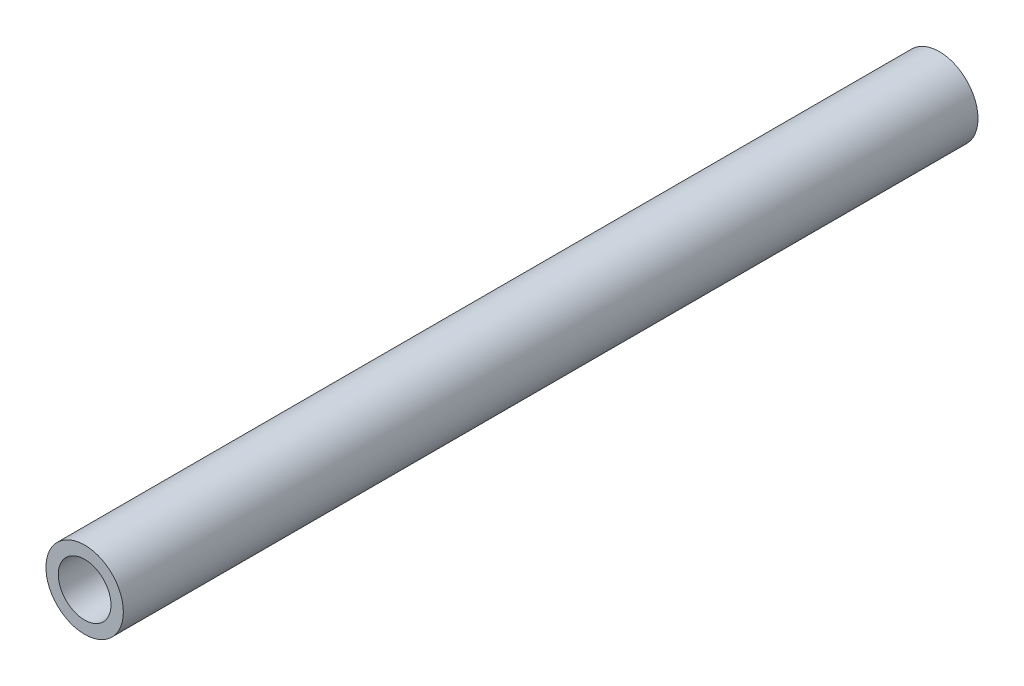
ISO-10303-21;
HEADER;
FILE_DESCRIPTION(('STEP AP214'),'2;1');
FILE_NAME('part.step','',(''),(''),'','','');
FILE_SCHEMA(('AUTOMOTIVE_DESIGN { 1 0 10303 214 1 1 1 1 }'));
ENDSEC;
DATA;
#1=APPLICATION_CONTEXT('core data for automotive mechanical design processes');
#2=APPLICATION_PROTOCOL_DEFINITION('international standard','automotive_design',2000,#1);
#3=PRODUCT_CONTEXT('',#1,'mechanical');
#4=PRODUCT('Part','Part','',(#3));
#5=PRODUCT_RELATED_PRODUCT_CATEGORY('part','',(#4));
#6=PRODUCT_DEFINITION_FORMATION('','',#4);
#7=PRODUCT_DEFINITION_CONTEXT('part definition',#1,'design');
#8=PRODUCT_DEFINITION('design','',#6,#7);
#9=PRODUCT_DEFINITION_SHAPE('','',#8);
#10=(LENGTH_UNIT() NAMED_UNIT(*) SI_UNIT(.MILLI.,.METRE.));
#11=(NAMED_UNIT(*) PLANE_ANGLE_UNIT() SI_UNIT($,.RADIAN.));
#12=(NAMED_UNIT(*) SI_UNIT($,.STERADIAN.) SOLID_ANGLE_UNIT());
#13=UNCERTAINTY_MEASURE_WITH_UNIT(LENGTH_MEASURE(1.E-05),#10,'distance_accuracy_value','');
#14=(GEOMETRIC_REPRESENTATION_CONTEXT(3) GLOBAL_UNCERTAINTY_ASSIGNED_CONTEXT((#13)) GLOBAL_UNIT_ASSIGNED_CONTEXT((#10,
#11,#12)) REPRESENTATION_CONTEXT('',''));
#15=CARTESIAN_POINT('',(0.,0.,0.));
#16=DIRECTION('',(0.,0.,1.));
#17=DIRECTION('',(1.,0.,0.));
#18=AXIS2_PLACEMENT_3D('',#15,#16,#17);
#19=CARTESIAN_POINT('',(-36.480993275143,23.345303086753,138.));
#20=DIRECTION('',(0.,0.,1.));
#21=DIRECTION('',(1.,0.,0.));
#22=AXIS2_PLACEMENT_3D('',#19,#20,#21);
#23=PLANE('',#22);
#24=CARTESIAN_POINT('',(-36.480993275143,23.345303086753,138.));
#25=DIRECTION('',(0.,0.,1.));
#26=DIRECTION('',(1.,0.,0.));
#27=AXIS2_PLACEMENT_3D('',#24,#25,#26);
#28=CIRCLE('',#27,6.25);
#29=CARTESIAN_POINT('',(-30.230993275143,23.345303086753,138.));
#30=VERTEX_POINT('',#29);
#31=EDGE_CURVE('E10',#30,#30,#28,.T.);
#32=ORIENTED_EDGE('',*,*,#31,.T.);
#33=EDGE_LOOP('',(#32));
#34=FACE_BOUND('',#33,.T.);
#35=CARTESIAN_POINT('',(-36.480993275143,23.345303086753,138.));
#36=DIRECTION('',(0.,0.,1.));
#37=DIRECTION('',(1.,0.,0.));
#38=AXIS2_PLACEMENT_3D('',#35,#36,#37);
#39=CIRCLE('',#38,4.25);
#40=CARTESIAN_POINT('',(-32.230993275143,23.345303086753,138.));
#41=VERTEX_POINT('',#40);
#42=EDGE_CURVE('E50',#41,#41,#39,.T.);
#43=ORIENTED_EDGE('',*,*,#42,.F.);
#44=EDGE_LOOP('',(#43));
#45=FACE_BOUND('',#44,.T.);
#46=ADVANCED_FACE('F37',(#34,#45),#23,.T.);
#47=CARTESIAN_POINT('',(-36.480993275143,23.345303086753,0.));
#48=DIRECTION('',(0.,0.,1.));
#49=DIRECTION('',(1.,0.,0.));
#50=AXIS2_PLACEMENT_3D('',#47,#48,#49);
#51=PLANE('',#50);
#52=CARTESIAN_POINT('',(-36.480993275143,23.345303086753,0.));
#53=DIRECTION('',(0.,0.,1.));
#54=DIRECTION('',(1.,0.,0.));
#55=AXIS2_PLACEMENT_3D('',#52,#53,#54);
#56=CIRCLE('',#55,6.25);
#57=CARTESIAN_POINT('',(-30.230993275143,23.345303086753,0.));
#58=VERTEX_POINT('',#57);
#59=EDGE_CURVE('E41',#58,#58,#56,.T.);
#60=ORIENTED_EDGE('',*,*,#59,.F.);
#61=EDGE_LOOP('',(#60));
#62=FACE_BOUND('',#61,.T.);
#63=CARTESIAN_POINT('',(-36.480993275143,23.345303086753,0.));
#64=DIRECTION('',(0.,0.,1.));
#65=DIRECTION('',(1.,0.,0.));
#66=AXIS2_PLACEMENT_3D('',#63,#64,#65);
#67=CIRCLE('',#66,4.25);
#68=CARTESIAN_POINT('',(-32.230993275143,23.345303086753,0.));
#69=VERTEX_POINT('',#68);
#70=EDGE_CURVE('E52',#69,#69,#67,.T.);
#71=ORIENTED_EDGE('',*,*,#70,.T.);
#72=EDGE_LOOP('',(#71));
#73=FACE_BOUND('',#72,.T.);
#74=ADVANCED_FACE('F64',(#62,#73),#51,.F.);
#75=CARTESIAN_POINT('',(-36.480993275143,23.345303086753,138.));
#76=DIRECTION('',(0.,0.,-1.));
#77=DIRECTION('',(-1.,0.,0.));
#78=AXIS2_PLACEMENT_3D('',#75,#76,#77);
#79=CYLINDRICAL_SURFACE('',#78,6.25);
#80=ORIENTED_EDGE('',*,*,#31,.F.);
#81=EDGE_LOOP('',(#80));
#82=FACE_BOUND('',#81,.T.);
#83=ORIENTED_EDGE('',*,*,#59,.T.);
#84=EDGE_LOOP('',(#83));
#85=FACE_BOUND('',#84,.T.);
#86=ADVANCED_FACE('F39',(#82,#85),#79,.T.);
#87=CARTESIAN_POINT('',(-36.480993275143,23.345303086753,138.));
#88=DIRECTION('',(0.,0.,-1.));
#89=DIRECTION('',(-1.,0.,0.));
#90=AXIS2_PLACEMENT_3D('',#87,#88,#89);
#91=CYLINDRICAL_SURFACE('',#90,4.25);
#92=ORIENTED_EDGE('',*,*,#42,.T.);
#93=EDGE_LOOP('',(#92));
#94=FACE_BOUND('',#93,.T.);
#95=ORIENTED_EDGE('',*,*,#70,.F.);
#96=EDGE_LOOP('',(#95));
#97=FACE_BOUND('',#96,.T.);
#98=ADVANCED_FACE('F60',(#94,#97),#91,.F.);
#99=CLOSED_SHELL('',(#46,#74,#86,#98));
#100=MANIFOLD_SOLID_BREP('B2',#99);
#101=ADVANCED_BREP_SHAPE_REPRESENTATION('',(#18,#100),#14);
#102=SHAPE_DEFINITION_REPRESENTATION(#9,#101);
ENDSEC;
END-ISO-10303-21;
